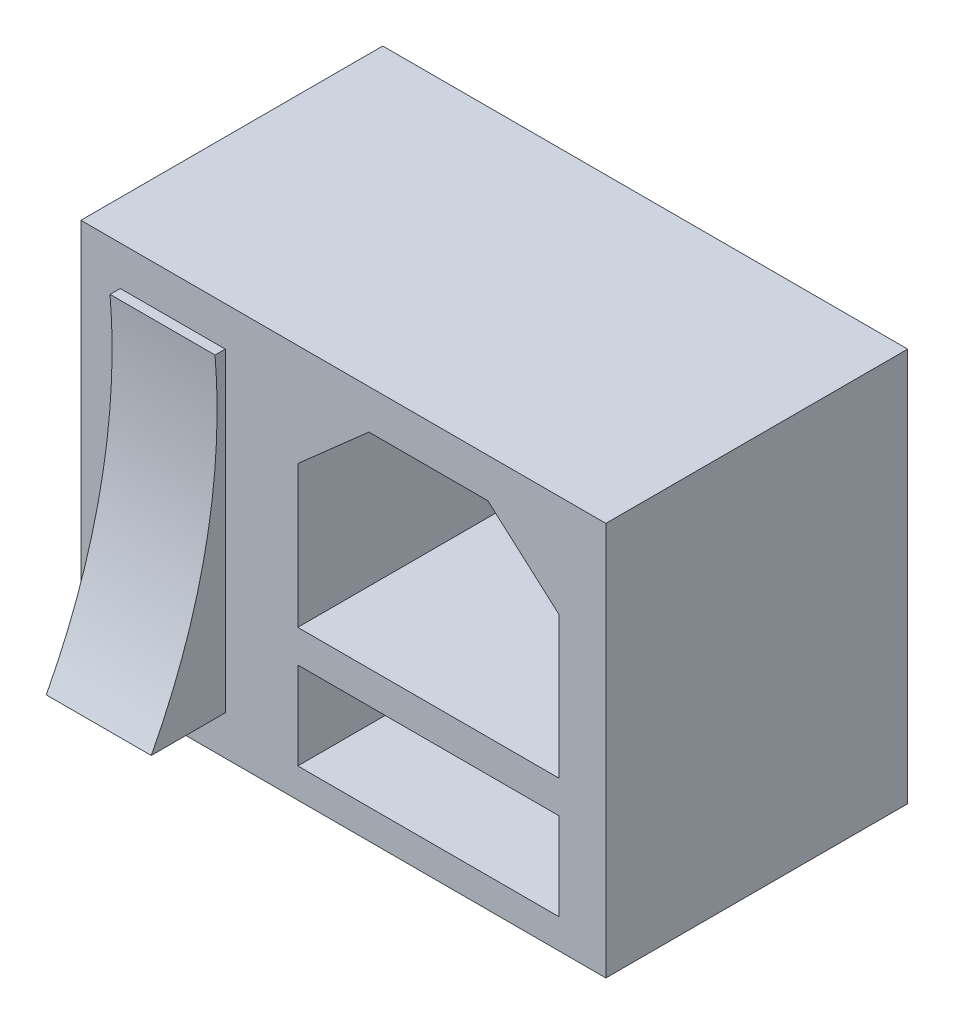
ISO-10303-21;
HEADER;
FILE_DESCRIPTION(('STEP AP214'),'2;1');
FILE_NAME('part.step','',(''),(''),'','','');
FILE_SCHEMA(('AUTOMOTIVE_DESIGN { 1 0 10303 214 1 1 1 1 }'));
ENDSEC;
DATA;
#1=APPLICATION_CONTEXT('core data for automotive mechanical design processes');
#2=APPLICATION_PROTOCOL_DEFINITION('international standard','automotive_design',2000,#1);
#3=PRODUCT_CONTEXT('',#1,'mechanical');
#4=PRODUCT('Part','Part','',(#3));
#5=PRODUCT_RELATED_PRODUCT_CATEGORY('part','',(#4));
#6=PRODUCT_DEFINITION_FORMATION('','',#4);
#7=PRODUCT_DEFINITION_CONTEXT('part definition',#1,'design');
#8=PRODUCT_DEFINITION('design','',#6,#7);
#9=PRODUCT_DEFINITION_SHAPE('','',#8);
#10=(LENGTH_UNIT() NAMED_UNIT(*) SI_UNIT(.MILLI.,.METRE.));
#11=(NAMED_UNIT(*) PLANE_ANGLE_UNIT() SI_UNIT($,.RADIAN.));
#12=(NAMED_UNIT(*) SI_UNIT($,.STERADIAN.) SOLID_ANGLE_UNIT());
#13=UNCERTAINTY_MEASURE_WITH_UNIT(LENGTH_MEASURE(1.E-05),#10,'distance_accuracy_value','');
#14=(GEOMETRIC_REPRESENTATION_CONTEXT(3) GLOBAL_UNCERTAINTY_ASSIGNED_CONTEXT((#13)) GLOBAL_UNIT_ASSIGNED_CONTEXT((#10,
#11,#12)) REPRESENTATION_CONTEXT('',''));
#15=CARTESIAN_POINT('',(0.,0.,0.));
#16=DIRECTION('',(0.,0.,1.));
#17=DIRECTION('',(1.,0.,0.));
#18=AXIS2_PLACEMENT_3D('',#15,#16,#17);
#19=CARTESIAN_POINT('',(20.,15.,23.));
#20=DIRECTION('',(-1.,0.,0.));
#21=DIRECTION('',(0.,0.,1.));
#22=AXIS2_PLACEMENT_3D('',#19,#20,#21);
#23=PLANE('',#22);
#24=DIRECTION('',(0.,1.,0.));
#25=VECTOR('',#24,1.);
#26=CARTESIAN_POINT('',(20.,15.,0.));
#27=LINE('',#26,#25);
#28=CARTESIAN_POINT('',(20.,-15.,0.));
#29=VERTEX_POINT('',#28);
#30=CARTESIAN_POINT('',(20.,15.,0.));
#31=VERTEX_POINT('',#30);
#32=EDGE_CURVE('E231',#29,#31,#27,.T.);
#33=ORIENTED_EDGE('',*,*,#32,.T.);
#34=DIRECTION('',(0.,0.,-1.));
#35=VECTOR('',#34,1.);
#36=CARTESIAN_POINT('',(20.,15.,23.));
#37=LINE('',#36,#35);
#38=CARTESIAN_POINT('',(20.,15.,23.));
#39=VERTEX_POINT('',#38);
#40=EDGE_CURVE('E11',#39,#31,#37,.T.);
#41=ORIENTED_EDGE('',*,*,#40,.F.);
#42=DIRECTION('',(0.,1.,0.));
#43=VECTOR('',#42,1.);
#44=CARTESIAN_POINT('',(20.,15.,23.));
#45=LINE('',#44,#43);
#46=CARTESIAN_POINT('',(20.,-15.,23.));
#47=VERTEX_POINT('',#46);
#48=EDGE_CURVE('E283',#47,#39,#45,.T.);
#49=ORIENTED_EDGE('',*,*,#48,.F.);
#50=DIRECTION('',(0.,0.,-1.));
#51=VECTOR('',#50,1.);
#52=CARTESIAN_POINT('',(20.,-15.,23.));
#53=LINE('',#52,#51);
#54=EDGE_CURVE('E293',#47,#29,#53,.T.);
#55=ORIENTED_EDGE('',*,*,#54,.T.);
#56=EDGE_LOOP('',(#33,#41,#49,#55));
#57=FACE_BOUND('',#56,.T.);
#58=ADVANCED_FACE('F33',(#57),#23,.F.);
#59=CARTESIAN_POINT('',(-20.,15.,23.));
#60=DIRECTION('',(0.,-1.,0.));
#61=DIRECTION('',(0.,0.,-1.));
#62=AXIS2_PLACEMENT_3D('',#59,#60,#61);
#63=PLANE('',#62);
#64=DIRECTION('',(-1.,0.,0.));
#65=VECTOR('',#64,1.);
#66=CARTESIAN_POINT('',(-20.,15.,0.));
#67=LINE('',#66,#65);
#68=CARTESIAN_POINT('',(-20.,15.,0.));
#69=VERTEX_POINT('',#68);
#70=EDGE_CURVE('E296',#31,#69,#67,.T.);
#71=ORIENTED_EDGE('',*,*,#70,.T.);
#72=DIRECTION('',(0.,0.,-1.));
#73=VECTOR('',#72,1.);
#74=CARTESIAN_POINT('',(-20.,15.,23.));
#75=LINE('',#74,#73);
#76=CARTESIAN_POINT('',(-20.,15.,23.));
#77=VERTEX_POINT('',#76);
#78=EDGE_CURVE('E40',#77,#69,#75,.T.);
#79=ORIENTED_EDGE('',*,*,#78,.F.);
#80=DIRECTION('',(-1.,0.,0.));
#81=VECTOR('',#80,1.);
#82=CARTESIAN_POINT('',(-20.,15.,23.));
#83=LINE('',#82,#81);
#84=EDGE_CURVE('E286',#39,#77,#83,.T.);
#85=ORIENTED_EDGE('',*,*,#84,.F.);
#86=ORIENTED_EDGE('',*,*,#40,.T.);
#87=EDGE_LOOP('',(#71,#79,#85,#86));
#88=FACE_BOUND('',#87,.T.);
#89=ADVANCED_FACE('F325',(#88),#63,.F.);
#90=CARTESIAN_POINT('',(-20.,15.,23.));
#91=DIRECTION('',(1.,0.,0.));
#92=DIRECTION('',(0.,1.,0.));
#93=AXIS2_PLACEMENT_3D('',#90,#91,#92);
#94=PLANE('',#93);
#95=DIRECTION('',(0.,-1.,0.));
#96=VECTOR('',#95,1.);
#97=CARTESIAN_POINT('',(-20.,15.,0.));
#98=LINE('',#97,#96);
#99=CARTESIAN_POINT('',(-20.,-15.,0.));
#100=VERTEX_POINT('',#99);
#101=EDGE_CURVE('E298',#69,#100,#98,.T.);
#102=ORIENTED_EDGE('',*,*,#101,.T.);
#103=DIRECTION('',(0.,0.,-1.));
#104=VECTOR('',#103,1.);
#105=CARTESIAN_POINT('',(-20.,-15.,23.));
#106=LINE('',#105,#104);
#107=CARTESIAN_POINT('',(-20.,-15.,23.));
#108=VERTEX_POINT('',#107);
#109=EDGE_CURVE('E303',#108,#100,#106,.T.);
#110=ORIENTED_EDGE('',*,*,#109,.F.);
#111=DIRECTION('',(0.,-1.,0.));
#112=VECTOR('',#111,1.);
#113=CARTESIAN_POINT('',(-20.,15.,23.));
#114=LINE('',#113,#112);
#115=EDGE_CURVE('E289',#77,#108,#114,.T.);
#116=ORIENTED_EDGE('',*,*,#115,.F.);
#117=ORIENTED_EDGE('',*,*,#78,.T.);
#118=EDGE_LOOP('',(#102,#110,#116,#117));
#119=FACE_BOUND('',#118,.T.);
#120=ADVANCED_FACE('F310',(#119),#94,.F.);
#121=CARTESIAN_POINT('',(-20.,-15.,23.));
#122=DIRECTION('',(0.,1.,0.));
#123=DIRECTION('',(0.,0.,1.));
#124=AXIS2_PLACEMENT_3D('',#121,#122,#123);
#125=PLANE('',#124);
#126=CARTESIAN_POINT('',(6.57832518058622,-15.,13.));
#127=DIRECTION('',(0.,1.,0.));
#128=DIRECTION('',(0.,0.,1.));
#129=AXIS2_PLACEMENT_3D('',#126,#127,#128);
#130=CIRCLE('',#129,2.);
#131=CARTESIAN_POINT('',(6.57832518058622,-15.,15.));
#132=VERTEX_POINT('',#131);
#133=EDGE_CURVE('E201',#132,#132,#130,.T.);
#134=ORIENTED_EDGE('',*,*,#133,.T.);
#135=EDGE_LOOP('',(#134));
#136=FACE_BOUND('',#135,.T.);
#137=DIRECTION('',(1.,0.,0.));
#138=VECTOR('',#137,1.);
#139=CARTESIAN_POINT('',(-20.,-15.,0.));
#140=LINE('',#139,#138);
#141=EDGE_CURVE('E287',#100,#29,#140,.T.);
#142=ORIENTED_EDGE('',*,*,#141,.T.);
#143=ORIENTED_EDGE('',*,*,#54,.F.);
#144=DIRECTION('',(1.,0.,0.));
#145=VECTOR('',#144,1.);
#146=CARTESIAN_POINT('',(-20.,-15.,23.));
#147=LINE('',#146,#145);
#148=EDGE_CURVE('E291',#108,#47,#147,.T.);
#149=ORIENTED_EDGE('',*,*,#148,.F.);
#150=ORIENTED_EDGE('',*,*,#109,.T.);
#151=EDGE_LOOP('',(#142,#143,#149,#150));
#152=FACE_BOUND('',#151,.T.);
#153=ADVANCED_FACE('F319',(#136,#152),#125,.F.);
#154=CARTESIAN_POINT('',(0.,0.,23.));
#155=DIRECTION('',(0.,0.,1.));
#156=DIRECTION('',(1.,0.,0.));
#157=AXIS2_PLACEMENT_3D('',#154,#155,#156);
#158=PLANE('',#157);
#159=DIRECTION('',(0.,-1.,0.));
#160=VECTOR('',#159,1.);
#161=CARTESIAN_POINT('',(-9.00000000000001,12.,23.));
#162=LINE('',#161,#160);
#163=CARTESIAN_POINT('',(-9.00000000000001,12.,23.));
#164=VERTEX_POINT('',#163);
#165=CARTESIAN_POINT('',(-9.00000000000001,-12.,23.));
#166=VERTEX_POINT('',#165);
#167=EDGE_CURVE('E175',#164,#166,#162,.T.);
#168=ORIENTED_EDGE('',*,*,#167,.T.);
#169=DIRECTION('',(-1.,0.,0.));
#170=VECTOR('',#169,1.);
#171=CARTESIAN_POINT('',(-9.00000000000001,-12.,23.));
#172=LINE('',#171,#170);
#173=CARTESIAN_POINT('',(-17.,-12.,23.));
#174=VERTEX_POINT('',#173);
#175=EDGE_CURVE('E159',#166,#174,#172,.T.);
#176=ORIENTED_EDGE('',*,*,#175,.T.);
#177=DIRECTION('',(0.,-1.,0.));
#178=VECTOR('',#177,1.);
#179=CARTESIAN_POINT('',(-17.,12.,23.));
#180=LINE('',#179,#178);
#181=CARTESIAN_POINT('',(-17.,12.,23.));
#182=VERTEX_POINT('',#181);
#183=EDGE_CURVE('E190',#182,#174,#180,.T.);
#184=ORIENTED_EDGE('',*,*,#183,.F.);
#185=DIRECTION('',(-1.,0.,0.));
#186=VECTOR('',#185,1.);
#187=CARTESIAN_POINT('',(-9.00000000000001,12.,23.));
#188=LINE('',#187,#186);
#189=EDGE_CURVE('E183',#164,#182,#188,.T.);
#190=ORIENTED_EDGE('',*,*,#189,.F.);
#191=EDGE_LOOP('',(#168,#176,#184,#190));
#192=FACE_BOUND('',#191,.T.);
#193=DIRECTION('',(-1.,0.,0.));
#194=VECTOR('',#193,1.);
#195=CARTESIAN_POINT('',(16.4251263942939,-6.08184780846643,23.));
#196=LINE('',#195,#194);
#197=CARTESIAN_POINT('',(16.4251263942939,-6.08184780846643,23.));
#198=VERTEX_POINT('',#197);
#199=CARTESIAN_POINT('',(-3.47534160483801,-6.08184780846643,23.));
#200=VERTEX_POINT('',#199);
#201=EDGE_CURVE('E55',#198,#200,#196,.T.);
#202=ORIENTED_EDGE('',*,*,#201,.F.);
#203=DIRECTION('',(0.,1.,0.));
#204=VECTOR('',#203,1.);
#205=CARTESIAN_POINT('',(16.4251263942939,-12.7429192177393,23.));
#206=LINE('',#205,#204);
#207=CARTESIAN_POINT('',(16.4251263942939,-12.7429192177393,23.));
#208=VERTEX_POINT('',#207);
#209=EDGE_CURVE('E209',#208,#198,#206,.T.);
#210=ORIENTED_EDGE('',*,*,#209,.F.);
#211=DIRECTION('',(1.,0.,0.));
#212=VECTOR('',#211,1.);
#213=CARTESIAN_POINT('',(-3.475341604838,-12.7429192177393,23.));
#214=LINE('',#213,#212);
#215=CARTESIAN_POINT('',(-3.475341604838,-12.7429192177393,23.));
#216=VERTEX_POINT('',#215);
#217=EDGE_CURVE('E224',#216,#208,#214,.T.);
#218=ORIENTED_EDGE('',*,*,#217,.F.);
#219=DIRECTION('',(0.,-1.,0.));
#220=VECTOR('',#219,1.);
#221=CARTESIAN_POINT('',(-3.47534160483801,-6.08184780846643,23.));
#222=LINE('',#221,#220);
#223=EDGE_CURVE('E220',#200,#216,#222,.T.);
#224=ORIENTED_EDGE('',*,*,#223,.F.);
#225=EDGE_LOOP('',(#202,#210,#218,#224));
#226=FACE_BOUND('',#225,.T.);
#227=DIRECTION('',(1.,0.,0.));
#228=VECTOR('',#227,1.);
#229=CARTESIAN_POINT('',(-3.47534160483801,-3.59946094786785,23.));
#230=LINE('',#229,#228);
#231=CARTESIAN_POINT('',(-3.47534160483801,-3.59946094786785,23.));
#232=VERTEX_POINT('',#231);
#233=CARTESIAN_POINT('',(16.4251263942939,-3.59946094786785,23.));
#234=VERTEX_POINT('',#233);
#235=EDGE_CURVE('E204',#232,#234,#230,.T.);
#236=ORIENTED_EDGE('',*,*,#235,.F.);
#237=DIRECTION('',(0.,-1.,0.));
#238=VECTOR('',#237,1.);
#239=CARTESIAN_POINT('',(-3.47534160483801,7.20854355023441,23.));
#240=LINE('',#239,#238);
#241=CARTESIAN_POINT('',(-3.47534160483801,7.20854355023441,23.));
#242=VERTEX_POINT('',#241);
#243=EDGE_CURVE('E241',#242,#232,#240,.T.);
#244=ORIENTED_EDGE('',*,*,#243,.F.);
#245=DIRECTION('',(-0.749329085481146,-0.66219779647171,0.));
#246=VECTOR('',#245,1.);
#247=CARTESIAN_POINT('',(1.94453637413555,11.9982031595599,23.));
#248=LINE('',#247,#246);
#249=CARTESIAN_POINT('',(1.94453637413555,11.9982031595599,23.));
#250=VERTEX_POINT('',#249);
#251=EDGE_CURVE('E267',#250,#242,#248,.T.);
#252=ORIENTED_EDGE('',*,*,#251,.F.);
#253=DIRECTION('',(-1.,0.,0.));
#254=VECTOR('',#253,1.);
#255=CARTESIAN_POINT('',(11.0052484153204,11.9982031595599,23.));
#256=LINE('',#255,#254);
#257=CARTESIAN_POINT('',(11.0052484153204,11.9982031595599,23.));
#258=VERTEX_POINT('',#257);
#259=EDGE_CURVE('E264',#258,#250,#256,.T.);
#260=ORIENTED_EDGE('',*,*,#259,.F.);
#261=DIRECTION('',(-0.749329085481146,0.662197796471711,0.));
#262=VECTOR('',#261,1.);
#263=CARTESIAN_POINT('',(16.4251263942939,7.20854355023441,23.));
#264=LINE('',#263,#262);
#265=CARTESIAN_POINT('',(16.4251263942939,7.20854355023441,23.));
#266=VERTEX_POINT('',#265);
#267=EDGE_CURVE('E261',#266,#258,#264,.T.);
#268=ORIENTED_EDGE('',*,*,#267,.F.);
#269=DIRECTION('',(0.,1.,0.));
#270=VECTOR('',#269,1.);
#271=CARTESIAN_POINT('',(16.4251263942939,-3.59946094786785,23.));
#272=LINE('',#271,#270);
#273=EDGE_CURVE('E258',#234,#266,#272,.T.);
#274=ORIENTED_EDGE('',*,*,#273,.F.);
#275=EDGE_LOOP('',(#236,#244,#252,#260,#268,#274));
#276=FACE_BOUND('',#275,.T.);
#277=ORIENTED_EDGE('',*,*,#48,.T.);
#278=ORIENTED_EDGE('',*,*,#84,.T.);
#279=ORIENTED_EDGE('',*,*,#115,.T.);
#280=ORIENTED_EDGE('',*,*,#148,.T.);
#281=EDGE_LOOP('',(#277,#278,#279,#280));
#282=FACE_BOUND('',#281,.T.);
#283=ADVANCED_FACE('F181',(#192,#226,#276,#282),#158,.T.);
#284=CARTESIAN_POINT('',(0.,0.,0.));
#285=DIRECTION('',(0.,0.,1.));
#286=DIRECTION('',(1.,0.,0.));
#287=AXIS2_PLACEMENT_3D('',#284,#285,#286);
#288=PLANE('',#287);
#289=ORIENTED_EDGE('',*,*,#32,.F.);
#290=ORIENTED_EDGE('',*,*,#141,.F.);
#291=ORIENTED_EDGE('',*,*,#101,.F.);
#292=ORIENTED_EDGE('',*,*,#70,.F.);
#293=EDGE_LOOP('',(#289,#290,#291,#292));
#294=FACE_BOUND('',#293,.T.);
#295=ADVANCED_FACE('F316',(#294),#288,.F.);
#296=CARTESIAN_POINT('',(-3.47534160483801,-3.59946094786785,4.));
#297=DIRECTION('',(0.,-1.,0.));
#298=DIRECTION('',(0.,0.,-1.));
#299=AXIS2_PLACEMENT_3D('',#296,#297,#298);
#300=PLANE('',#299);
#301=ORIENTED_EDGE('',*,*,#235,.T.);
#302=DIRECTION('',(0.,0.,1.));
#303=VECTOR('',#302,1.);
#304=CARTESIAN_POINT('',(16.4251263942939,-3.59946094786785,4.));
#305=LINE('',#304,#303);
#306=CARTESIAN_POINT('',(16.4251263942939,-3.59946094786785,4.));
#307=VERTEX_POINT('',#306);
#308=EDGE_CURVE('E256',#307,#234,#305,.T.);
#309=ORIENTED_EDGE('',*,*,#308,.F.);
#310=DIRECTION('',(1.,0.,0.));
#311=VECTOR('',#310,1.);
#312=CARTESIAN_POINT('',(-3.47534160483801,-3.59946094786785,4.));
#313=LINE('',#312,#311);
#314=CARTESIAN_POINT('',(-3.47534160483801,-3.59946094786785,4.));
#315=VERTEX_POINT('',#314);
#316=EDGE_CURVE('E237',#315,#307,#313,.T.);
#317=ORIENTED_EDGE('',*,*,#316,.F.);
#318=DIRECTION('',(0.,0.,1.));
#319=VECTOR('',#318,1.);
#320=CARTESIAN_POINT('',(-3.47534160483801,-3.59946094786785,4.));
#321=LINE('',#320,#319);
#322=EDGE_CURVE('E221',#315,#232,#321,.T.);
#323=ORIENTED_EDGE('',*,*,#322,.T.);
#324=EDGE_LOOP('',(#301,#309,#317,#323));
#325=FACE_BOUND('',#324,.T.);
#326=ADVANCED_FACE('F338',(#325),#300,.F.);
#327=CARTESIAN_POINT('',(-3.47534160483801,7.20854355023441,4.));
#328=DIRECTION('',(-1.,0.,0.));
#329=DIRECTION('',(0.,0.,1.));
#330=AXIS2_PLACEMENT_3D('',#327,#328,#329);
#331=PLANE('',#330);
#332=ORIENTED_EDGE('',*,*,#243,.T.);
#333=ORIENTED_EDGE('',*,*,#322,.F.);
#334=DIRECTION('',(0.,-1.,0.));
#335=VECTOR('',#334,1.);
#336=CARTESIAN_POINT('',(-3.47534160483801,7.20854355023441,4.));
#337=LINE('',#336,#335);
#338=CARTESIAN_POINT('',(-3.47534160483801,7.20854355023441,4.));
#339=VERTEX_POINT('',#338);
#340=EDGE_CURVE('E253',#339,#315,#337,.T.);
#341=ORIENTED_EDGE('',*,*,#340,.F.);
#342=DIRECTION('',(0.,0.,1.));
#343=VECTOR('',#342,1.);
#344=CARTESIAN_POINT('',(-3.47534160483801,7.20854355023441,4.));
#345=LINE('',#344,#343);
#346=EDGE_CURVE('E273',#339,#242,#345,.T.);
#347=ORIENTED_EDGE('',*,*,#346,.T.);
#348=EDGE_LOOP('',(#332,#333,#341,#347));
#349=FACE_BOUND('',#348,.T.);
#350=ADVANCED_FACE('F343',(#349),#331,.F.);
#351=CARTESIAN_POINT('',(1.94453637413555,11.9982031595599,4.));
#352=DIRECTION('',(-0.66219779647171,0.749329085481146,0.));
#353=DIRECTION('',(-0.749329085481146,-0.66219779647171,0.));
#354=AXIS2_PLACEMENT_3D('',#351,#352,#353);
#355=PLANE('',#354);
#356=ORIENTED_EDGE('',*,*,#251,.T.);
#357=ORIENTED_EDGE('',*,*,#346,.F.);
#358=DIRECTION('',(-0.749329085481146,-0.66219779647171,0.));
#359=VECTOR('',#358,1.);
#360=CARTESIAN_POINT('',(1.94453637413555,11.9982031595599,4.));
#361=LINE('',#360,#359);
#362=CARTESIAN_POINT('',(1.94453637413555,11.9982031595599,4.));
#363=VERTEX_POINT('',#362);
#364=EDGE_CURVE('E250',#363,#339,#361,.T.);
#365=ORIENTED_EDGE('',*,*,#364,.F.);
#366=DIRECTION('',(0.,0.,1.));
#367=VECTOR('',#366,1.);
#368=CARTESIAN_POINT('',(1.94453637413555,11.9982031595599,4.));
#369=LINE('',#368,#367);
#370=EDGE_CURVE('E275',#363,#250,#369,.T.);
#371=ORIENTED_EDGE('',*,*,#370,.T.);
#372=EDGE_LOOP('',(#356,#357,#365,#371));
#373=FACE_BOUND('',#372,.T.);
#374=ADVANCED_FACE('F357',(#373),#355,.F.);
#375=CARTESIAN_POINT('',(11.0052484153204,11.9982031595599,4.));
#376=DIRECTION('',(0.,1.,0.));
#377=DIRECTION('',(0.,0.,1.));
#378=AXIS2_PLACEMENT_3D('',#375,#376,#377);
#379=PLANE('',#378);
#380=ORIENTED_EDGE('',*,*,#259,.T.);
#381=ORIENTED_EDGE('',*,*,#370,.F.);
#382=DIRECTION('',(-1.,0.,0.));
#383=VECTOR('',#382,1.);
#384=CARTESIAN_POINT('',(11.0052484153204,11.9982031595599,4.));
#385=LINE('',#384,#383);
#386=CARTESIAN_POINT('',(11.0052484153204,11.9982031595599,4.));
#387=VERTEX_POINT('',#386);
#388=EDGE_CURVE('E247',#387,#363,#385,.T.);
#389=ORIENTED_EDGE('',*,*,#388,.F.);
#390=DIRECTION('',(0.,0.,1.));
#391=VECTOR('',#390,1.);
#392=CARTESIAN_POINT('',(11.0052484153204,11.9982031595599,4.));
#393=LINE('',#392,#391);
#394=EDGE_CURVE('E277',#387,#258,#393,.T.);
#395=ORIENTED_EDGE('',*,*,#394,.T.);
#396=EDGE_LOOP('',(#380,#381,#389,#395));
#397=FACE_BOUND('',#396,.T.);
#398=ADVANCED_FACE('F353',(#397),#379,.F.);
#399=CARTESIAN_POINT('',(16.4251263942939,7.20854355023441,4.));
#400=DIRECTION('',(0.662197796471711,0.749329085481146,0.));
#401=DIRECTION('',(-0.749329085481146,0.662197796471711,0.));
#402=AXIS2_PLACEMENT_3D('',#399,#400,#401);
#403=PLANE('',#402);
#404=ORIENTED_EDGE('',*,*,#267,.T.);
#405=ORIENTED_EDGE('',*,*,#394,.F.);
#406=DIRECTION('',(-0.749329085481146,0.662197796471711,0.));
#407=VECTOR('',#406,1.);
#408=CARTESIAN_POINT('',(16.4251263942939,7.20854355023441,4.));
#409=LINE('',#408,#407);
#410=CARTESIAN_POINT('',(16.4251263942939,7.20854355023441,4.));
#411=VERTEX_POINT('',#410);
#412=EDGE_CURVE('E244',#411,#387,#409,.T.);
#413=ORIENTED_EDGE('',*,*,#412,.F.);
#414=DIRECTION('',(0.,0.,1.));
#415=VECTOR('',#414,1.);
#416=CARTESIAN_POINT('',(16.4251263942939,7.20854355023441,4.));
#417=LINE('',#416,#415);
#418=EDGE_CURVE('E279',#411,#266,#417,.T.);
#419=ORIENTED_EDGE('',*,*,#418,.T.);
#420=EDGE_LOOP('',(#404,#405,#413,#419));
#421=FACE_BOUND('',#420,.T.);
#422=ADVANCED_FACE('F349',(#421),#403,.F.);
#423=CARTESIAN_POINT('',(16.4251263942939,-3.59946094786785,4.));
#424=DIRECTION('',(1.,0.,0.));
#425=DIRECTION('',(0.,0.,-1.));
#426=AXIS2_PLACEMENT_3D('',#423,#424,#425);
#427=PLANE('',#426);
#428=ORIENTED_EDGE('',*,*,#273,.T.);
#429=ORIENTED_EDGE('',*,*,#418,.F.);
#430=DIRECTION('',(0.,1.,0.));
#431=VECTOR('',#430,1.);
#432=CARTESIAN_POINT('',(16.4251263942939,-3.59946094786785,4.));
#433=LINE('',#432,#431);
#434=EDGE_CURVE('E240',#307,#411,#433,.T.);
#435=ORIENTED_EDGE('',*,*,#434,.F.);
#436=ORIENTED_EDGE('',*,*,#308,.T.);
#437=EDGE_LOOP('',(#428,#429,#435,#436));
#438=FACE_BOUND('',#437,.T.);
#439=ADVANCED_FACE('F345',(#438),#427,.F.);
#440=CARTESIAN_POINT('',(0.,0.,4.));
#441=DIRECTION('',(0.,0.,1.));
#442=DIRECTION('',(1.,0.,0.));
#443=AXIS2_PLACEMENT_3D('',#440,#441,#442);
#444=PLANE('',#443);
#445=ORIENTED_EDGE('',*,*,#316,.T.);
#446=ORIENTED_EDGE('',*,*,#434,.T.);
#447=ORIENTED_EDGE('',*,*,#412,.T.);
#448=ORIENTED_EDGE('',*,*,#388,.T.);
#449=ORIENTED_EDGE('',*,*,#364,.T.);
#450=ORIENTED_EDGE('',*,*,#340,.T.);
#451=EDGE_LOOP('',(#445,#446,#447,#448,#449,#450));
#452=FACE_BOUND('',#451,.T.);
#453=ADVANCED_FACE('F348',(#452),#444,.T.);
#454=CARTESIAN_POINT('',(16.4251263942939,-6.08184780846643,4.));
#455=DIRECTION('',(0.,1.,0.));
#456=DIRECTION('',(0.,0.,1.));
#457=AXIS2_PLACEMENT_3D('',#454,#455,#456);
#458=PLANE('',#457);
#459=ORIENTED_EDGE('',*,*,#201,.T.);
#460=DIRECTION('',(0.,0.,1.));
#461=VECTOR('',#460,1.);
#462=CARTESIAN_POINT('',(-3.47534160483801,-6.08184780846643,4.));
#463=LINE('',#462,#461);
#464=CARTESIAN_POINT('',(-3.47534160483801,-6.08184780846643,4.));
#465=VERTEX_POINT('',#464);
#466=EDGE_CURVE('E218',#465,#200,#463,.T.);
#467=ORIENTED_EDGE('',*,*,#466,.F.);
#468=DIRECTION('',(-1.,0.,0.));
#469=VECTOR('',#468,1.);
#470=CARTESIAN_POINT('',(16.4251263942939,-6.08184780846643,4.));
#471=LINE('',#470,#469);
#472=CARTESIAN_POINT('',(16.4251263942939,-6.08184780846643,4.));
#473=VERTEX_POINT('',#472);
#474=EDGE_CURVE('E205',#473,#465,#471,.T.);
#475=ORIENTED_EDGE('',*,*,#474,.F.);
#476=DIRECTION('',(0.,0.,1.));
#477=VECTOR('',#476,1.);
#478=CARTESIAN_POINT('',(16.4251263942939,-6.08184780846643,4.));
#479=LINE('',#478,#477);
#480=EDGE_CURVE('E229',#473,#198,#479,.T.);
#481=ORIENTED_EDGE('',*,*,#480,.T.);
#482=EDGE_LOOP('',(#459,#467,#475,#481));
#483=FACE_BOUND('',#482,.T.);
#484=ADVANCED_FACE('F367',(#483),#458,.F.);
#485=CARTESIAN_POINT('',(16.4251263942939,-12.7429192177393,4.));
#486=DIRECTION('',(1.,0.,0.));
#487=DIRECTION('',(0.,0.,-1.));
#488=AXIS2_PLACEMENT_3D('',#485,#486,#487);
#489=PLANE('',#488);
#490=ORIENTED_EDGE('',*,*,#209,.T.);
#491=ORIENTED_EDGE('',*,*,#480,.F.);
#492=DIRECTION('',(0.,1.,0.));
#493=VECTOR('',#492,1.);
#494=CARTESIAN_POINT('',(16.4251263942939,-12.7429192177393,4.));
#495=LINE('',#494,#493);
#496=CARTESIAN_POINT('',(16.4251263942939,-12.7429192177393,4.));
#497=VERTEX_POINT('',#496);
#498=EDGE_CURVE('E215',#497,#473,#495,.T.);
#499=ORIENTED_EDGE('',*,*,#498,.F.);
#500=DIRECTION('',(0.,0.,1.));
#501=VECTOR('',#500,1.);
#502=CARTESIAN_POINT('',(16.4251263942939,-12.7429192177393,4.));
#503=LINE('',#502,#501);
#504=EDGE_CURVE('E232',#497,#208,#503,.T.);
#505=ORIENTED_EDGE('',*,*,#504,.T.);
#506=EDGE_LOOP('',(#490,#491,#499,#505));
#507=FACE_BOUND('',#506,.T.);
#508=ADVANCED_FACE('F371',(#507),#489,.F.);
#509=CARTESIAN_POINT('',(-3.475341604838,-12.7429192177393,4.));
#510=DIRECTION('',(0.,-1.,0.));
#511=DIRECTION('',(0.,0.,-1.));
#512=AXIS2_PLACEMENT_3D('',#509,#510,#511);
#513=PLANE('',#512);
#514=CARTESIAN_POINT('',(6.57832518058622,-12.7429192177393,13.));
#515=DIRECTION('',(0.,1.,0.));
#516=DIRECTION('',(0.,0.,1.));
#517=AXIS2_PLACEMENT_3D('',#514,#515,#516);
#518=CIRCLE('',#517,2.);
#519=CARTESIAN_POINT('',(6.57832518058622,-12.7429192177393,15.));
#520=VERTEX_POINT('',#519);
#521=EDGE_CURVE('E195',#520,#520,#518,.T.);
#522=ORIENTED_EDGE('',*,*,#521,.F.);
#523=EDGE_LOOP('',(#522));
#524=FACE_BOUND('',#523,.T.);
#525=ORIENTED_EDGE('',*,*,#217,.T.);
#526=ORIENTED_EDGE('',*,*,#504,.F.);
#527=DIRECTION('',(1.,0.,0.));
#528=VECTOR('',#527,1.);
#529=CARTESIAN_POINT('',(-3.475341604838,-12.7429192177393,4.));
#530=LINE('',#529,#528);
#531=CARTESIAN_POINT('',(-3.475341604838,-12.7429192177393,4.));
#532=VERTEX_POINT('',#531);
#533=EDGE_CURVE('E212',#532,#497,#530,.T.);
#534=ORIENTED_EDGE('',*,*,#533,.F.);
#535=DIRECTION('',(0.,0.,1.));
#536=VECTOR('',#535,1.);
#537=CARTESIAN_POINT('',(-3.475341604838,-12.7429192177393,4.));
#538=LINE('',#537,#536);
#539=EDGE_CURVE('E234',#532,#216,#538,.T.);
#540=ORIENTED_EDGE('',*,*,#539,.T.);
#541=EDGE_LOOP('',(#525,#526,#534,#540));
#542=FACE_BOUND('',#541,.T.);
#543=ADVANCED_FACE('F376',(#524,#542),#513,.F.);
#544=CARTESIAN_POINT('',(-3.47534160483801,-6.08184780846643,4.));
#545=DIRECTION('',(-1.,0.,0.));
#546=DIRECTION('',(0.,-1.,0.));
#547=AXIS2_PLACEMENT_3D('',#544,#545,#546);
#548=PLANE('',#547);
#549=ORIENTED_EDGE('',*,*,#223,.T.);
#550=ORIENTED_EDGE('',*,*,#539,.F.);
#551=DIRECTION('',(0.,-1.,0.));
#552=VECTOR('',#551,1.);
#553=CARTESIAN_POINT('',(-3.47534160483801,-6.08184780846643,4.));
#554=LINE('',#553,#552);
#555=EDGE_CURVE('E208',#465,#532,#554,.T.);
#556=ORIENTED_EDGE('',*,*,#555,.F.);
#557=ORIENTED_EDGE('',*,*,#466,.T.);
#558=EDGE_LOOP('',(#549,#550,#556,#557));
#559=FACE_BOUND('',#558,.T.);
#560=ADVANCED_FACE('F372',(#559),#548,.F.);
#561=CARTESIAN_POINT('',(0.,0.,4.));
#562=DIRECTION('',(0.,0.,1.));
#563=DIRECTION('',(1.,0.,0.));
#564=AXIS2_PLACEMENT_3D('',#561,#562,#563);
#565=PLANE('',#564);
#566=ORIENTED_EDGE('',*,*,#474,.T.);
#567=ORIENTED_EDGE('',*,*,#555,.T.);
#568=ORIENTED_EDGE('',*,*,#533,.T.);
#569=ORIENTED_EDGE('',*,*,#498,.T.);
#570=EDGE_LOOP('',(#566,#567,#568,#569));
#571=FACE_BOUND('',#570,.T.);
#572=ADVANCED_FACE('F375',(#571),#565,.T.);
#573=CARTESIAN_POINT('',(6.57832518058622,-31.7429192177393,13.));
#574=DIRECTION('',(0.,1.,0.));
#575=DIRECTION('',(0.,0.,1.));
#576=AXIS2_PLACEMENT_3D('',#573,#574,#575);
#577=CYLINDRICAL_SURFACE('',#576,2.);
#578=ORIENTED_EDGE('',*,*,#521,.T.);
#579=EDGE_LOOP('',(#578));
#580=FACE_BOUND('',#579,.T.);
#581=ORIENTED_EDGE('',*,*,#133,.F.);
#582=EDGE_LOOP('',(#581));
#583=FACE_BOUND('',#582,.T.);
#584=ADVANCED_FACE('F386',(#580,#583),#577,.F.);
#585=CARTESIAN_POINT('',(-9.00000000000001,12.,23.));
#586=DIRECTION('',(0.,1.,0.));
#587=DIRECTION('',(-1.,0.,0.));
#588=AXIS2_PLACEMENT_3D('',#585,#586,#587);
#589=PLANE('',#588);
#590=DIRECTION('',(0.,0.,-1.));
#591=VECTOR('',#590,1.);
#592=CARTESIAN_POINT('',(-17.,12.,23.));
#593=LINE('',#592,#591);
#594=CARTESIAN_POINT('',(-17.,12.,23.7781957636402));
#595=VERTEX_POINT('',#594);
#596=EDGE_CURVE('E47',#595,#182,#593,.T.);
#597=ORIENTED_EDGE('',*,*,#596,.F.);
#598=DIRECTION('',(-1.,0.,0.));
#599=VECTOR('',#598,1.);
#600=CARTESIAN_POINT('',(-9.00000000000001,12.,23.7781957636402));
#601=LINE('',#600,#599);
#602=CARTESIAN_POINT('',(-9.00000000000001,12.,23.7781957636402));
#603=VERTEX_POINT('',#602);
#604=EDGE_CURVE('E196',#603,#595,#601,.T.);
#605=ORIENTED_EDGE('',*,*,#604,.F.);
#606=DIRECTION('',(0.,0.,-1.));
#607=VECTOR('',#606,1.);
#608=CARTESIAN_POINT('',(-9.00000000000001,12.,23.));
#609=LINE('',#608,#607);
#610=EDGE_CURVE('E169',#603,#164,#609,.T.);
#611=ORIENTED_EDGE('',*,*,#610,.T.);
#612=ORIENTED_EDGE('',*,*,#189,.T.);
#613=EDGE_LOOP('',(#597,#605,#611,#612));
#614=FACE_BOUND('',#613,.T.);
#615=ADVANCED_FACE('F390',(#614),#589,.T.);
#616=CARTESIAN_POINT('',(-9.00000000000001,8.29483175527814,67.1789939595198));
#617=DIRECTION('',(-1.,0.,0.));
#618=DIRECTION('',(0.,-1.,0.));
#619=AXIS2_PLACEMENT_3D('',#616,#617,#618);
#620=CYLINDRICAL_SURFACE('',#619,43.558667975056);
#621=CARTESIAN_POINT('',(-17.,8.29483175527813,67.1789939595198));
#622=DIRECTION('',(1.,0.,0.));
#623=DIRECTION('',(0.,1.,0.));
#624=AXIS2_PLACEMENT_3D('',#621,#622,#623);
#625=CIRCLE('',#624,43.558667975056);
#626=CARTESIAN_POINT('',(-17.,-12.,28.6371029863706));
#627=VERTEX_POINT('',#626);
#628=EDGE_CURVE('E185',#627,#595,#625,.T.);
#629=ORIENTED_EDGE('',*,*,#628,.F.);
#630=DIRECTION('',(-1.,0.,0.));
#631=VECTOR('',#630,1.);
#632=CARTESIAN_POINT('',(-9.00000000000001,-12.,28.6371029863706));
#633=LINE('',#632,#631);
#634=CARTESIAN_POINT('',(-9.00000000000001,-12.,28.6371029863706));
#635=VERTEX_POINT('',#634);
#636=EDGE_CURVE('E168',#635,#627,#633,.T.);
#637=ORIENTED_EDGE('',*,*,#636,.F.);
#638=CARTESIAN_POINT('',(-9.00000000000001,8.29483175527814,67.1789939595198));
#639=DIRECTION('',(1.,0.,0.));
#640=DIRECTION('',(0.,1.,0.));
#641=AXIS2_PLACEMENT_3D('',#638,#639,#640);
#642=CIRCLE('',#641,43.558667975056);
#643=EDGE_CURVE('E178',#635,#603,#642,.T.);
#644=ORIENTED_EDGE('',*,*,#643,.T.);
#645=ORIENTED_EDGE('',*,*,#604,.T.);
#646=EDGE_LOOP('',(#629,#637,#644,#645));
#647=FACE_BOUND('',#646,.T.);
#648=ADVANCED_FACE('F394',(#647),#620,.F.);
#649=CARTESIAN_POINT('',(-9.00000000000001,-12.,23.));
#650=DIRECTION('',(0.,-1.,0.));
#651=DIRECTION('',(0.,0.,-1.));
#652=AXIS2_PLACEMENT_3D('',#649,#650,#651);
#653=PLANE('',#652);
#654=DIRECTION('',(0.,0.,1.));
#655=VECTOR('',#654,1.);
#656=CARTESIAN_POINT('',(-17.,-12.,23.));
#657=LINE('',#656,#655);
#658=EDGE_CURVE('E164',#174,#627,#657,.T.);
#659=ORIENTED_EDGE('',*,*,#658,.F.);
#660=ORIENTED_EDGE('',*,*,#175,.F.);
#661=DIRECTION('',(0.,0.,1.));
#662=VECTOR('',#661,1.);
#663=CARTESIAN_POINT('',(-9.00000000000001,-12.,23.));
#664=LINE('',#663,#662);
#665=EDGE_CURVE('E162',#166,#635,#664,.T.);
#666=ORIENTED_EDGE('',*,*,#665,.T.);
#667=ORIENTED_EDGE('',*,*,#636,.T.);
#668=EDGE_LOOP('',(#659,#660,#666,#667));
#669=FACE_BOUND('',#668,.T.);
#670=ADVANCED_FACE('F161',(#669),#653,.T.);
#671=CARTESIAN_POINT('',(-9.00000000000001,8.29483175527814,67.1789939595198));
#672=DIRECTION('',(1.,0.,0.));
#673=DIRECTION('',(0.,1.,0.));
#674=AXIS2_PLACEMENT_3D('',#671,#672,#673);
#675=PLANE('',#674);
#676=ORIENTED_EDGE('',*,*,#167,.F.);
#677=ORIENTED_EDGE('',*,*,#610,.F.);
#678=ORIENTED_EDGE('',*,*,#643,.F.);
#679=ORIENTED_EDGE('',*,*,#665,.F.);
#680=EDGE_LOOP('',(#676,#677,#678,#679));
#681=FACE_BOUND('',#680,.T.);
#682=ADVANCED_FACE('F173',(#681),#675,.T.);
#683=CARTESIAN_POINT('',(-17.,8.29483175527813,67.1789939595198));
#684=DIRECTION('',(1.,0.,0.));
#685=DIRECTION('',(0.,1.,0.));
#686=AXIS2_PLACEMENT_3D('',#683,#684,#685);
#687=PLANE('',#686);
#688=ORIENTED_EDGE('',*,*,#183,.T.);
#689=ORIENTED_EDGE('',*,*,#658,.T.);
#690=ORIENTED_EDGE('',*,*,#628,.T.);
#691=ORIENTED_EDGE('',*,*,#596,.T.);
#692=EDGE_LOOP('',(#688,#689,#690,#691));
#693=FACE_BOUND('',#692,.T.);
#694=ADVANCED_FACE('F401',(#693),#687,.F.);
#695=CLOSED_SHELL('',(#58,#89,#120,#153,#283,#295,#326,#350,#374,#398,#422,#439,#453,#484,#508,
#543,#560,#572,#584,#615,#648,#670,#682,#694));
#696=MANIFOLD_SOLID_BREP('B2',#695);
#697=ADVANCED_BREP_SHAPE_REPRESENTATION('',(#18,#696),#14);
#698=SHAPE_DEFINITION_REPRESENTATION(#9,#697);
ENDSEC;
END-ISO-10303-21;
